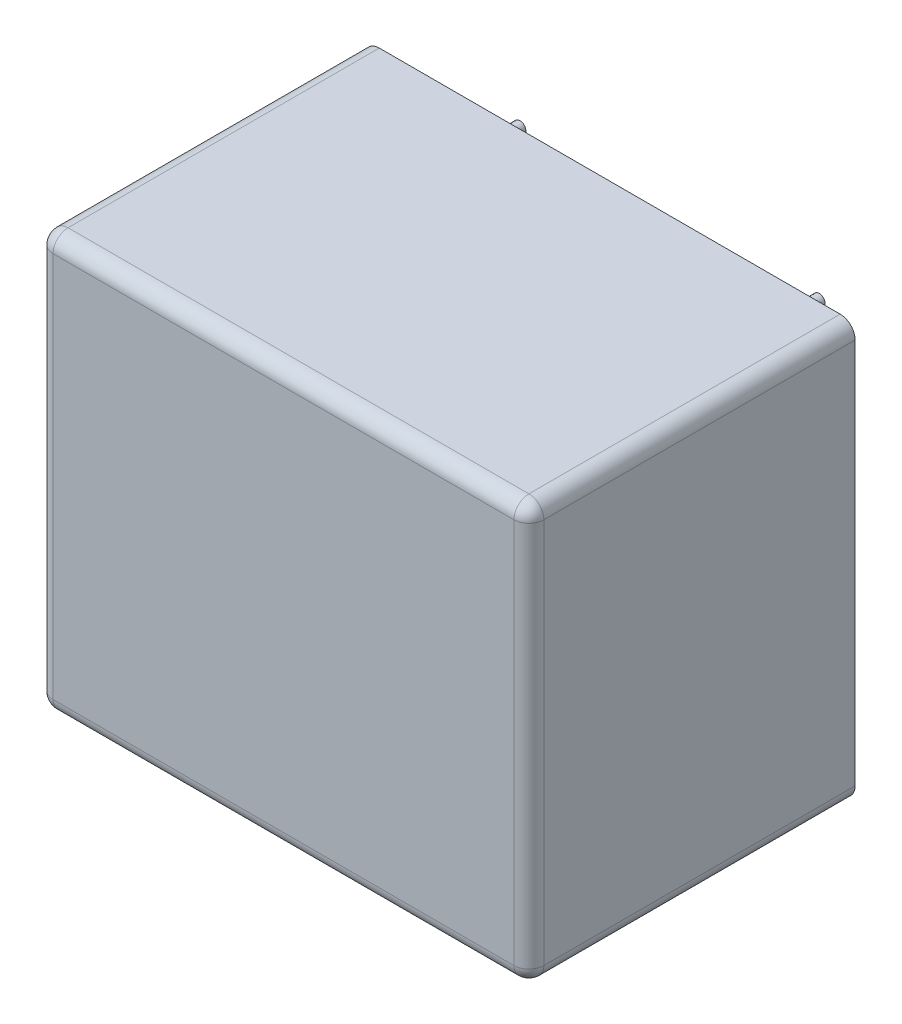
ISO-10303-21;
HEADER;
FILE_DESCRIPTION(('STEP AP214'),'2;1');
FILE_NAME('part.step','',(''),(''),'','','');
FILE_SCHEMA(('AUTOMOTIVE_DESIGN { 1 0 10303 214 1 1 1 1 }'));
ENDSEC;
DATA;
#1=APPLICATION_CONTEXT('core data for automotive mechanical design processes');
#2=APPLICATION_PROTOCOL_DEFINITION('international standard','automotive_design',2000,#1);
#3=PRODUCT_CONTEXT('',#1,'mechanical');
#4=PRODUCT('Part','Part','',(#3));
#5=PRODUCT_RELATED_PRODUCT_CATEGORY('part','',(#4));
#6=PRODUCT_DEFINITION_FORMATION('','',#4);
#7=PRODUCT_DEFINITION_CONTEXT('part definition',#1,'design');
#8=PRODUCT_DEFINITION('design','',#6,#7);
#9=PRODUCT_DEFINITION_SHAPE('','',#8);
#10=(LENGTH_UNIT() NAMED_UNIT(*) SI_UNIT(.MILLI.,.METRE.));
#11=(NAMED_UNIT(*) PLANE_ANGLE_UNIT() SI_UNIT($,.RADIAN.));
#12=(NAMED_UNIT(*) SI_UNIT($,.STERADIAN.) SOLID_ANGLE_UNIT());
#13=UNCERTAINTY_MEASURE_WITH_UNIT(LENGTH_MEASURE(1.E-05),#10,'distance_accuracy_value','');
#14=(GEOMETRIC_REPRESENTATION_CONTEXT(3) GLOBAL_UNCERTAINTY_ASSIGNED_CONTEXT((#13)) GLOBAL_UNIT_ASSIGNED_CONTEXT((#10,
#11,#12)) REPRESENTATION_CONTEXT('',''));
#15=CARTESIAN_POINT('',(0.,0.,0.));
#16=DIRECTION('',(0.,0.,1.));
#17=DIRECTION('',(1.,0.,0.));
#18=AXIS2_PLACEMENT_3D('',#15,#16,#17);
#19=CARTESIAN_POINT('',(31.8,1.,21.8));
#20=DIRECTION('',(0.,0.,-1.));
#21=DIRECTION('',(-1.,0.,0.));
#22=AXIS2_PLACEMENT_3D('',#19,#20,#21);
#23=CYLINDRICAL_SURFACE('',#22,1.);
#24=DIRECTION('',(0.,0.,-1.));
#25=VECTOR('',#24,1.);
#26=CARTESIAN_POINT('',(32.8,1.00000000000001,21.8));
#27=LINE('',#26,#25);
#28=CARTESIAN_POINT('',(32.8,1.00000000000001,20.8));
#29=VERTEX_POINT('',#28);
#30=CARTESIAN_POINT('',(32.8,1.00000000000001,0.));
#31=VERTEX_POINT('',#30);
#32=EDGE_CURVE('E113',#29,#31,#27,.T.);
#33=ORIENTED_EDGE('',*,*,#32,.F.);
#34=CARTESIAN_POINT('',(31.8,1.,20.8));
#35=DIRECTION('',(0.,0.,-1.));
#36=DIRECTION('',(-1.,0.,0.));
#37=AXIS2_PLACEMENT_3D('',#34,#35,#36);
#38=CIRCLE('',#37,1.);
#39=CARTESIAN_POINT('',(31.8,0.,20.8));
#40=VERTEX_POINT('',#39);
#41=EDGE_CURVE('E185',#29,#40,#38,.T.);
#42=ORIENTED_EDGE('',*,*,#41,.T.);
#43=DIRECTION('',(0.,0.,-1.));
#44=VECTOR('',#43,1.);
#45=CARTESIAN_POINT('',(31.8,0.,21.8));
#46=LINE('',#45,#44);
#47=CARTESIAN_POINT('',(31.8,0.,0.));
#48=VERTEX_POINT('',#47);
#49=EDGE_CURVE('E137',#40,#48,#46,.T.);
#50=ORIENTED_EDGE('',*,*,#49,.T.);
#51=CARTESIAN_POINT('',(31.8,1.,0.));
#52=DIRECTION('',(0.,0.,1.));
#53=DIRECTION('',(1.,0.,0.));
#54=AXIS2_PLACEMENT_3D('',#51,#52,#53);
#55=CIRCLE('',#54,1.);
#56=EDGE_CURVE('E131',#48,#31,#55,.T.);
#57=ORIENTED_EDGE('',*,*,#56,.T.);
#58=EDGE_LOOP('',(#33,#42,#50,#57));
#59=FACE_BOUND('',#58,.T.);
#60=ADVANCED_FACE('F35',(#59),#23,.T.);
#61=CARTESIAN_POINT('',(32.8,1.00000000000001,21.8));
#62=DIRECTION('',(-1.,0.,0.));
#63=DIRECTION('',(0.,0.,1.));
#64=AXIS2_PLACEMENT_3D('',#61,#62,#63);
#65=PLANE('',#64);
#66=DIRECTION('',(0.,0.,-1.));
#67=VECTOR('',#66,1.);
#68=CARTESIAN_POINT('',(32.8,26.8,21.8));
#69=LINE('',#68,#67);
#70=CARTESIAN_POINT('',(32.8,26.8,20.8));
#71=VERTEX_POINT('',#70);
#72=CARTESIAN_POINT('',(32.8,26.8,0.));
#73=VERTEX_POINT('',#72);
#74=EDGE_CURVE('E125',#71,#73,#69,.T.);
#75=ORIENTED_EDGE('',*,*,#74,.F.);
#76=DIRECTION('',(0.,1.,0.));
#77=VECTOR('',#76,1.);
#78=CARTESIAN_POINT('',(32.8,1.00000000000001,20.8));
#79=LINE('',#78,#77);
#80=EDGE_CURVE('E120',#71,#29,#79,.F.);
#81=ORIENTED_EDGE('',*,*,#80,.T.);
#82=ORIENTED_EDGE('',*,*,#32,.T.);
#83=DIRECTION('',(0.,1.,0.));
#84=VECTOR('',#83,1.);
#85=CARTESIAN_POINT('',(32.8,1.00000000000001,0.));
#86=LINE('',#85,#84);
#87=EDGE_CURVE('E117',#31,#73,#86,.T.);
#88=ORIENTED_EDGE('',*,*,#87,.T.);
#89=EDGE_LOOP('',(#75,#81,#82,#88));
#90=FACE_BOUND('',#89,.T.);
#91=ADVANCED_FACE('F116',(#90),#65,.F.);
#92=CARTESIAN_POINT('',(31.8,26.8,21.8));
#93=DIRECTION('',(0.,0.,-1.));
#94=DIRECTION('',(-1.,0.,0.));
#95=AXIS2_PLACEMENT_3D('',#92,#93,#94);
#96=CYLINDRICAL_SURFACE('',#95,1.);
#97=DIRECTION('',(0.,0.,-1.));
#98=VECTOR('',#97,1.);
#99=CARTESIAN_POINT('',(31.8,27.8,21.8));
#100=LINE('',#99,#98);
#101=CARTESIAN_POINT('',(31.8,27.8,20.8));
#102=VERTEX_POINT('',#101);
#103=CARTESIAN_POINT('',(31.8,27.8,0.));
#104=VERTEX_POINT('',#103);
#105=EDGE_CURVE('E170',#102,#104,#100,.T.);
#106=ORIENTED_EDGE('',*,*,#105,.F.);
#107=CARTESIAN_POINT('',(31.8,26.8,20.8));
#108=DIRECTION('',(0.,0.,-1.));
#109=DIRECTION('',(-1.,0.,0.));
#110=AXIS2_PLACEMENT_3D('',#107,#108,#109);
#111=CIRCLE('',#110,1.);
#112=EDGE_CURVE('E124',#102,#71,#111,.T.);
#113=ORIENTED_EDGE('',*,*,#112,.T.);
#114=ORIENTED_EDGE('',*,*,#74,.T.);
#115=CARTESIAN_POINT('',(31.8,26.8,0.));
#116=DIRECTION('',(0.,0.,1.));
#117=DIRECTION('',(-1.,0.,0.));
#118=AXIS2_PLACEMENT_3D('',#115,#116,#117);
#119=CIRCLE('',#118,1.);
#120=EDGE_CURVE('E134',#73,#104,#119,.T.);
#121=ORIENTED_EDGE('',*,*,#120,.T.);
#122=EDGE_LOOP('',(#106,#113,#114,#121));
#123=FACE_BOUND('',#122,.T.);
#124=ADVANCED_FACE('F252',(#123),#96,.T.);
#125=CARTESIAN_POINT('',(1.00000000000001,27.8,21.8));
#126=DIRECTION('',(0.,-1.,0.));
#127=DIRECTION('',(0.,0.,-1.));
#128=AXIS2_PLACEMENT_3D('',#125,#126,#127);
#129=PLANE('',#128);
#130=DIRECTION('',(0.,0.,-1.));
#131=VECTOR('',#130,1.);
#132=CARTESIAN_POINT('',(1.00000000000001,27.8,21.8));
#133=LINE('',#132,#131);
#134=CARTESIAN_POINT('',(1.00000000000001,27.8,20.8));
#135=VERTEX_POINT('',#134);
#136=CARTESIAN_POINT('',(1.00000000000001,27.8,0.));
#137=VERTEX_POINT('',#136);
#138=EDGE_CURVE('E168',#135,#137,#133,.T.);
#139=ORIENTED_EDGE('',*,*,#138,.F.);
#140=DIRECTION('',(-1.,0.,0.));
#141=VECTOR('',#140,1.);
#142=CARTESIAN_POINT('',(31.8,27.8,20.8));
#143=LINE('',#142,#141);
#144=EDGE_CURVE('E11',#135,#102,#143,.F.);
#145=ORIENTED_EDGE('',*,*,#144,.T.);
#146=ORIENTED_EDGE('',*,*,#105,.T.);
#147=DIRECTION('',(-1.,0.,0.));
#148=VECTOR('',#147,1.);
#149=CARTESIAN_POINT('',(1.00000000000001,27.8,0.));
#150=LINE('',#149,#148);
#151=EDGE_CURVE('E147',#104,#137,#150,.T.);
#152=ORIENTED_EDGE('',*,*,#151,.T.);
#153=EDGE_LOOP('',(#139,#145,#146,#152));
#154=FACE_BOUND('',#153,.T.);
#155=ADVANCED_FACE('F479',(#154),#129,.F.);
#156=CARTESIAN_POINT('',(1.,26.8,21.8));
#157=DIRECTION('',(0.,0.,-1.));
#158=DIRECTION('',(-1.,0.,0.));
#159=AXIS2_PLACEMENT_3D('',#156,#157,#158);
#160=CYLINDRICAL_SURFACE('',#159,1.);
#161=DIRECTION('',(0.,0.,-1.));
#162=VECTOR('',#161,1.);
#163=CARTESIAN_POINT('',(0.,26.8,21.8));
#164=LINE('',#163,#162);
#165=CARTESIAN_POINT('',(0.,26.8,20.8));
#166=VERTEX_POINT('',#165);
#167=CARTESIAN_POINT('',(0.,26.8,0.));
#168=VERTEX_POINT('',#167);
#169=EDGE_CURVE('E166',#166,#168,#164,.T.);
#170=ORIENTED_EDGE('',*,*,#169,.F.);
#171=CARTESIAN_POINT('',(1.,26.8,20.8));
#172=DIRECTION('',(0.,0.,-1.));
#173=DIRECTION('',(-1.,0.,0.));
#174=AXIS2_PLACEMENT_3D('',#171,#172,#173);
#175=CIRCLE('',#174,1.);
#176=EDGE_CURVE('E44',#166,#135,#175,.T.);
#177=ORIENTED_EDGE('',*,*,#176,.T.);
#178=ORIENTED_EDGE('',*,*,#138,.T.);
#179=CARTESIAN_POINT('',(1.,26.8,0.));
#180=DIRECTION('',(0.,0.,1.));
#181=DIRECTION('',(-1.,0.,0.));
#182=AXIS2_PLACEMENT_3D('',#179,#180,#181);
#183=CIRCLE('',#182,1.);
#184=EDGE_CURVE('E150',#137,#168,#183,.T.);
#185=ORIENTED_EDGE('',*,*,#184,.T.);
#186=EDGE_LOOP('',(#170,#177,#178,#185));
#187=FACE_BOUND('',#186,.T.);
#188=ADVANCED_FACE('F469',(#187),#160,.T.);
#189=CARTESIAN_POINT('',(0.,1.00000000000001,21.8));
#190=DIRECTION('',(1.,0.,0.));
#191=DIRECTION('',(0.,0.,-1.));
#192=AXIS2_PLACEMENT_3D('',#189,#190,#191);
#193=PLANE('',#192);
#194=DIRECTION('',(0.,0.,-1.));
#195=VECTOR('',#194,1.);
#196=CARTESIAN_POINT('',(0.,1.,21.8));
#197=LINE('',#196,#195);
#198=CARTESIAN_POINT('',(0.,1.,20.8));
#199=VERTEX_POINT('',#198);
#200=CARTESIAN_POINT('',(0.,1.,0.));
#201=VERTEX_POINT('',#200);
#202=EDGE_CURVE('E164',#199,#201,#197,.T.);
#203=ORIENTED_EDGE('',*,*,#202,.F.);
#204=DIRECTION('',(0.,-1.,0.));
#205=VECTOR('',#204,1.);
#206=CARTESIAN_POINT('',(0.,26.8,20.8));
#207=LINE('',#206,#205);
#208=EDGE_CURVE('E59',#199,#166,#207,.F.);
#209=ORIENTED_EDGE('',*,*,#208,.T.);
#210=ORIENTED_EDGE('',*,*,#169,.T.);
#211=DIRECTION('',(0.,-1.,0.));
#212=VECTOR('',#211,1.);
#213=CARTESIAN_POINT('',(0.,1.00000000000001,0.));
#214=LINE('',#213,#212);
#215=EDGE_CURVE('E153',#168,#201,#214,.T.);
#216=ORIENTED_EDGE('',*,*,#215,.T.);
#217=EDGE_LOOP('',(#203,#209,#210,#216));
#218=FACE_BOUND('',#217,.T.);
#219=ADVANCED_FACE('F459',(#218),#193,.F.);
#220=CARTESIAN_POINT('',(1.,1.,21.8));
#221=DIRECTION('',(0.,0.,-1.));
#222=DIRECTION('',(-1.,0.,0.));
#223=AXIS2_PLACEMENT_3D('',#220,#221,#222);
#224=CYLINDRICAL_SURFACE('',#223,1.);
#225=DIRECTION('',(0.,0.,-1.));
#226=VECTOR('',#225,1.);
#227=CARTESIAN_POINT('',(1.00000000000001,0.,21.8));
#228=LINE('',#227,#226);
#229=CARTESIAN_POINT('',(1.00000000000001,0.,20.8));
#230=VERTEX_POINT('',#229);
#231=CARTESIAN_POINT('',(1.00000000000001,0.,0.));
#232=VERTEX_POINT('',#231);
#233=EDGE_CURVE('E162',#230,#232,#228,.T.);
#234=ORIENTED_EDGE('',*,*,#233,.F.);
#235=CARTESIAN_POINT('',(1.,1.,20.8));
#236=DIRECTION('',(0.,0.,-1.));
#237=DIRECTION('',(-1.,0.,0.));
#238=AXIS2_PLACEMENT_3D('',#235,#236,#237);
#239=CIRCLE('',#238,1.);
#240=EDGE_CURVE('E189',#230,#199,#239,.T.);
#241=ORIENTED_EDGE('',*,*,#240,.T.);
#242=ORIENTED_EDGE('',*,*,#202,.T.);
#243=CARTESIAN_POINT('',(1.,1.,0.));
#244=DIRECTION('',(0.,0.,1.));
#245=DIRECTION('',(-1.,0.,0.));
#246=AXIS2_PLACEMENT_3D('',#243,#244,#245);
#247=CIRCLE('',#246,1.);
#248=EDGE_CURVE('E156',#201,#232,#247,.T.);
#249=ORIENTED_EDGE('',*,*,#248,.T.);
#250=EDGE_LOOP('',(#234,#241,#242,#249));
#251=FACE_BOUND('',#250,.T.);
#252=ADVANCED_FACE('F449',(#251),#224,.T.);
#253=CARTESIAN_POINT('',(1.00000000000001,0.,21.8));
#254=DIRECTION('',(0.,1.,0.));
#255=DIRECTION('',(0.,0.,1.));
#256=AXIS2_PLACEMENT_3D('',#253,#254,#255);
#257=PLANE('',#256);
#258=ORIENTED_EDGE('',*,*,#49,.F.);
#259=DIRECTION('',(1.,0.,0.));
#260=VECTOR('',#259,1.);
#261=CARTESIAN_POINT('',(1.00000000000001,0.,20.8));
#262=LINE('',#261,#260);
#263=EDGE_CURVE('E187',#40,#230,#262,.F.);
#264=ORIENTED_EDGE('',*,*,#263,.T.);
#265=ORIENTED_EDGE('',*,*,#233,.T.);
#266=DIRECTION('',(1.,0.,0.));
#267=VECTOR('',#266,1.);
#268=CARTESIAN_POINT('',(1.00000000000001,0.,0.));
#269=LINE('',#268,#267);
#270=EDGE_CURVE('E159',#232,#48,#269,.T.);
#271=ORIENTED_EDGE('',*,*,#270,.T.);
#272=EDGE_LOOP('',(#258,#264,#265,#271));
#273=FACE_BOUND('',#272,.T.);
#274=ADVANCED_FACE('F440',(#273),#257,.F.);
#275=CARTESIAN_POINT('',(31.8,1.,21.8));
#276=DIRECTION('',(0.,0.,1.));
#277=DIRECTION('',(1.,0.,0.));
#278=AXIS2_PLACEMENT_3D('',#275,#276,#277);
#279=PLANE('',#278);
#280=DIRECTION('',(1.,0.,0.));
#281=VECTOR('',#280,1.);
#282=CARTESIAN_POINT('',(31.8,1.,21.8));
#283=LINE('',#282,#281);
#284=CARTESIAN_POINT('',(1.,1.,21.8));
#285=VERTEX_POINT('',#284);
#286=CARTESIAN_POINT('',(31.8,1.,21.8));
#287=VERTEX_POINT('',#286);
#288=EDGE_CURVE('E179',#285,#287,#283,.T.);
#289=ORIENTED_EDGE('',*,*,#288,.T.);
#290=DIRECTION('',(0.,1.,0.));
#291=VECTOR('',#290,1.);
#292=CARTESIAN_POINT('',(31.8,26.8,21.8));
#293=LINE('',#292,#291);
#294=CARTESIAN_POINT('',(31.8,26.8,21.8));
#295=VERTEX_POINT('',#294);
#296=EDGE_CURVE('E181',#287,#295,#293,.T.);
#297=ORIENTED_EDGE('',*,*,#296,.T.);
#298=DIRECTION('',(-1.,0.,0.));
#299=VECTOR('',#298,1.);
#300=CARTESIAN_POINT('',(1.00000000000001,26.8,21.8));
#301=LINE('',#300,#299);
#302=CARTESIAN_POINT('',(1.,26.8,21.8));
#303=VERTEX_POINT('',#302);
#304=EDGE_CURVE('E175',#295,#303,#301,.T.);
#305=ORIENTED_EDGE('',*,*,#304,.T.);
#306=DIRECTION('',(0.,-1.,0.));
#307=VECTOR('',#306,1.);
#308=CARTESIAN_POINT('',(1.,1.,21.8));
#309=LINE('',#308,#307);
#310=EDGE_CURVE('E177',#303,#285,#309,.T.);
#311=ORIENTED_EDGE('',*,*,#310,.T.);
#312=EDGE_LOOP('',(#289,#297,#305,#311));
#313=FACE_BOUND('',#312,.T.);
#314=ADVANCED_FACE('F225',(#313),#279,.T.);
#315=CARTESIAN_POINT('',(31.8,1.,0.));
#316=DIRECTION('',(0.,0.,1.));
#317=DIRECTION('',(1.,0.,0.));
#318=AXIS2_PLACEMENT_3D('',#315,#316,#317);
#319=PLANE('',#318);
#320=CARTESIAN_POINT('',(11.4,3.9,0.));
#321=DIRECTION('',(0.,0.,1.));
#322=DIRECTION('',(1.,0.,0.));
#323=AXIS2_PLACEMENT_3D('',#320,#321,#322);
#324=CIRCLE('',#323,0.400000000000001);
#325=CARTESIAN_POINT('',(11.8,3.9,0.));
#326=VERTEX_POINT('',#325);
#327=EDGE_CURVE('E536',#326,#326,#324,.T.);
#328=ORIENTED_EDGE('',*,*,#327,.T.);
#329=EDGE_LOOP('',(#328));
#330=FACE_BOUND('',#329,.T.);
#331=CARTESIAN_POINT('',(6.4,23.9,0.));
#332=DIRECTION('',(0.,0.,1.));
#333=DIRECTION('',(1.,0.,0.));
#334=AXIS2_PLACEMENT_3D('',#331,#332,#333);
#335=CIRCLE('',#334,0.400000000000002);
#336=CARTESIAN_POINT('',(6.8,23.9,0.));
#337=VERTEX_POINT('',#336);
#338=EDGE_CURVE('E540',#337,#337,#335,.T.);
#339=ORIENTED_EDGE('',*,*,#338,.T.);
#340=EDGE_LOOP('',(#339));
#341=FACE_BOUND('',#340,.T.);
#342=CARTESIAN_POINT('',(26.4,23.9,0.));
#343=DIRECTION('',(0.,0.,1.));
#344=DIRECTION('',(1.,0.,0.));
#345=AXIS2_PLACEMENT_3D('',#342,#343,#344);
#346=CIRCLE('',#345,0.400000000000005);
#347=CARTESIAN_POINT('',(26.8,23.9,0.));
#348=VERTEX_POINT('',#347);
#349=EDGE_CURVE('E544',#348,#348,#346,.T.);
#350=ORIENTED_EDGE('',*,*,#349,.T.);
#351=EDGE_LOOP('',(#350));
#352=FACE_BOUND('',#351,.T.);
#353=CARTESIAN_POINT('',(21.4,3.9,0.));
#354=DIRECTION('',(0.,0.,1.));
#355=DIRECTION('',(1.,0.,0.));
#356=AXIS2_PLACEMENT_3D('',#353,#354,#355);
#357=CIRCLE('',#356,0.400000000000001);
#358=CARTESIAN_POINT('',(21.8,3.9,0.));
#359=VERTEX_POINT('',#358);
#360=EDGE_CURVE('E143',#359,#359,#357,.T.);
#361=ORIENTED_EDGE('',*,*,#360,.T.);
#362=EDGE_LOOP('',(#361));
#363=FACE_BOUND('',#362,.T.);
#364=ORIENTED_EDGE('',*,*,#56,.F.);
#365=ORIENTED_EDGE('',*,*,#270,.F.);
#366=ORIENTED_EDGE('',*,*,#248,.F.);
#367=ORIENTED_EDGE('',*,*,#215,.F.);
#368=ORIENTED_EDGE('',*,*,#184,.F.);
#369=ORIENTED_EDGE('',*,*,#151,.F.);
#370=ORIENTED_EDGE('',*,*,#120,.F.);
#371=ORIENTED_EDGE('',*,*,#87,.F.);
#372=EDGE_LOOP('',(#364,#365,#366,#367,#368,#369,#370,#371));
#373=FACE_BOUND('',#372,.T.);
#374=ADVANCED_FACE('F129',(#330,#341,#352,#363,#373),#319,.F.);
#375=CARTESIAN_POINT('',(1.,1.,20.8));
#376=DIRECTION('',(0.,0.,1.));
#377=DIRECTION('',(1.,0.,0.));
#378=AXIS2_PLACEMENT_3D('',#375,#376,#377);
#379=SPHERICAL_SURFACE('',#378,1.);
#380=CARTESIAN_POINT('',(1.,1.,20.8));
#381=DIRECTION('',(0.,1.,0.));
#382=DIRECTION('',(0.,0.,1.));
#383=AXIS2_PLACEMENT_3D('',#380,#381,#382);
#384=CIRCLE('',#383,1.);
#385=EDGE_CURVE('E141',#199,#285,#384,.T.);
#386=ORIENTED_EDGE('',*,*,#385,.F.);
#387=ORIENTED_EDGE('',*,*,#240,.F.);
#388=CARTESIAN_POINT('',(1.,1.,20.8));
#389=DIRECTION('',(1.,0.,0.));
#390=DIRECTION('',(0.,1.,0.));
#391=AXIS2_PLACEMENT_3D('',#388,#389,#390);
#392=CIRCLE('',#391,1.);
#393=EDGE_CURVE('E39',#285,#230,#392,.T.);
#394=ORIENTED_EDGE('',*,*,#393,.F.);
#395=EDGE_LOOP('',(#386,#387,#394));
#396=FACE_BOUND('',#395,.T.);
#397=ADVANCED_FACE('F37',(#396),#379,.T.);
#398=CARTESIAN_POINT('',(31.8,1.,20.8));
#399=DIRECTION('',(-1.,0.,0.));
#400=DIRECTION('',(0.,0.,1.));
#401=AXIS2_PLACEMENT_3D('',#398,#399,#400);
#402=CYLINDRICAL_SURFACE('',#401,1.);
#403=ORIENTED_EDGE('',*,*,#393,.T.);
#404=ORIENTED_EDGE('',*,*,#263,.F.);
#405=CARTESIAN_POINT('',(31.8,1.,20.8));
#406=DIRECTION('',(1.,0.,0.));
#407=DIRECTION('',(0.,1.,0.));
#408=AXIS2_PLACEMENT_3D('',#405,#406,#407);
#409=CIRCLE('',#408,1.);
#410=EDGE_CURVE('E207',#287,#40,#409,.T.);
#411=ORIENTED_EDGE('',*,*,#410,.F.);
#412=ORIENTED_EDGE('',*,*,#288,.F.);
#413=EDGE_LOOP('',(#403,#404,#411,#412));
#414=FACE_BOUND('',#413,.T.);
#415=ADVANCED_FACE('F222',(#414),#402,.T.);
#416=CARTESIAN_POINT('',(1.,1.,20.8));
#417=DIRECTION('',(0.,1.,0.));
#418=DIRECTION('',(0.,0.,1.));
#419=AXIS2_PLACEMENT_3D('',#416,#417,#418);
#420=CYLINDRICAL_SURFACE('',#419,1.);
#421=ORIENTED_EDGE('',*,*,#385,.T.);
#422=ORIENTED_EDGE('',*,*,#310,.F.);
#423=CARTESIAN_POINT('',(1.,26.8,20.8));
#424=DIRECTION('',(0.,1.,0.));
#425=DIRECTION('',(0.,0.,1.));
#426=AXIS2_PLACEMENT_3D('',#423,#424,#425);
#427=CIRCLE('',#426,1.);
#428=EDGE_CURVE('E204',#166,#303,#427,.T.);
#429=ORIENTED_EDGE('',*,*,#428,.F.);
#430=ORIENTED_EDGE('',*,*,#208,.F.);
#431=EDGE_LOOP('',(#421,#422,#429,#430));
#432=FACE_BOUND('',#431,.T.);
#433=ADVANCED_FACE('F214',(#432),#420,.T.);
#434=CARTESIAN_POINT('',(31.8,1.,20.8));
#435=DIRECTION('',(0.,0.,1.));
#436=DIRECTION('',(1.,0.,0.));
#437=AXIS2_PLACEMENT_3D('',#434,#435,#436);
#438=SPHERICAL_SURFACE('',#437,1.);
#439=ORIENTED_EDGE('',*,*,#410,.T.);
#440=ORIENTED_EDGE('',*,*,#41,.F.);
#441=CARTESIAN_POINT('',(31.8,1.,20.8));
#442=DIRECTION('',(0.,1.,0.));
#443=DIRECTION('',(-1.,0.,0.));
#444=AXIS2_PLACEMENT_3D('',#441,#442,#443);
#445=CIRCLE('',#444,1.);
#446=EDGE_CURVE('E201',#287,#29,#445,.T.);
#447=ORIENTED_EDGE('',*,*,#446,.F.);
#448=EDGE_LOOP('',(#439,#440,#447));
#449=FACE_BOUND('',#448,.T.);
#450=ADVANCED_FACE('F237',(#449),#438,.T.);
#451=CARTESIAN_POINT('',(1.,26.8,20.8));
#452=DIRECTION('',(0.,0.,1.));
#453=DIRECTION('',(1.,0.,0.));
#454=AXIS2_PLACEMENT_3D('',#451,#452,#453);
#455=SPHERICAL_SURFACE('',#454,1.);
#456=ORIENTED_EDGE('',*,*,#176,.F.);
#457=ORIENTED_EDGE('',*,*,#428,.T.);
#458=CARTESIAN_POINT('',(1.,26.8,20.8));
#459=DIRECTION('',(1.,0.,0.));
#460=DIRECTION('',(0.,1.,0.));
#461=AXIS2_PLACEMENT_3D('',#458,#459,#460);
#462=CIRCLE('',#461,1.);
#463=EDGE_CURVE('E198',#135,#303,#462,.T.);
#464=ORIENTED_EDGE('',*,*,#463,.F.);
#465=EDGE_LOOP('',(#456,#457,#464));
#466=FACE_BOUND('',#465,.T.);
#467=ADVANCED_FACE('F234',(#466),#455,.T.);
#468=CARTESIAN_POINT('',(31.8,1.,20.8));
#469=DIRECTION('',(0.,-1.,0.));
#470=DIRECTION('',(0.,0.,-1.));
#471=AXIS2_PLACEMENT_3D('',#468,#469,#470);
#472=CYLINDRICAL_SURFACE('',#471,1.);
#473=ORIENTED_EDGE('',*,*,#446,.T.);
#474=ORIENTED_EDGE('',*,*,#80,.F.);
#475=CARTESIAN_POINT('',(31.8,26.8,20.8));
#476=DIRECTION('',(0.,1.,0.));
#477=DIRECTION('',(-1.,0.,0.));
#478=AXIS2_PLACEMENT_3D('',#475,#476,#477);
#479=CIRCLE('',#478,1.);
#480=EDGE_CURVE('E195',#295,#71,#479,.T.);
#481=ORIENTED_EDGE('',*,*,#480,.F.);
#482=ORIENTED_EDGE('',*,*,#296,.F.);
#483=EDGE_LOOP('',(#473,#474,#481,#482));
#484=FACE_BOUND('',#483,.T.);
#485=ADVANCED_FACE('F236',(#484),#472,.T.);
#486=CARTESIAN_POINT('',(31.8,26.8,20.8));
#487=DIRECTION('',(1.,0.,0.));
#488=DIRECTION('',(0.,0.,-1.));
#489=AXIS2_PLACEMENT_3D('',#486,#487,#488);
#490=CYLINDRICAL_SURFACE('',#489,1.);
#491=ORIENTED_EDGE('',*,*,#463,.T.);
#492=ORIENTED_EDGE('',*,*,#304,.F.);
#493=CARTESIAN_POINT('',(31.8,26.8,20.8));
#494=DIRECTION('',(1.,0.,0.));
#495=DIRECTION('',(0.,0.,-1.));
#496=AXIS2_PLACEMENT_3D('',#493,#494,#495);
#497=CIRCLE('',#496,1.);
#498=EDGE_CURVE('E193',#102,#295,#497,.T.);
#499=ORIENTED_EDGE('',*,*,#498,.F.);
#500=ORIENTED_EDGE('',*,*,#144,.F.);
#501=EDGE_LOOP('',(#491,#492,#499,#500));
#502=FACE_BOUND('',#501,.T.);
#503=ADVANCED_FACE('F230',(#502),#490,.T.);
#504=CARTESIAN_POINT('',(31.8,26.8,20.8));
#505=DIRECTION('',(0.,0.,1.));
#506=DIRECTION('',(1.,0.,0.));
#507=AXIS2_PLACEMENT_3D('',#504,#505,#506);
#508=SPHERICAL_SURFACE('',#507,1.);
#509=ORIENTED_EDGE('',*,*,#480,.T.);
#510=ORIENTED_EDGE('',*,*,#112,.F.);
#511=ORIENTED_EDGE('',*,*,#498,.T.);
#512=EDGE_LOOP('',(#509,#510,#511));
#513=FACE_BOUND('',#512,.T.);
#514=ADVANCED_FACE('F256',(#513),#508,.T.);
#515=CARTESIAN_POINT('',(21.4,3.9,-4.));
#516=DIRECTION('',(0.,0.,1.));
#517=DIRECTION('',(1.,0.,0.));
#518=AXIS2_PLACEMENT_3D('',#515,#516,#517);
#519=CYLINDRICAL_SURFACE('',#518,0.400000000000001);
#520=CARTESIAN_POINT('',(21.4,3.9,-4.));
#521=DIRECTION('',(0.,0.,1.));
#522=DIRECTION('',(1.,0.,0.));
#523=AXIS2_PLACEMENT_3D('',#520,#521,#522);
#524=CIRCLE('',#523,0.400000000000001);
#525=CARTESIAN_POINT('',(21.8,3.9,-4.));
#526=VERTEX_POINT('',#525);
#527=EDGE_CURVE('E196',#526,#526,#524,.T.);
#528=ORIENTED_EDGE('',*,*,#527,.T.);
#529=EDGE_LOOP('',(#528));
#530=FACE_BOUND('',#529,.T.);
#531=ORIENTED_EDGE('',*,*,#360,.F.);
#532=EDGE_LOOP('',(#531));
#533=FACE_BOUND('',#532,.T.);
#534=ADVANCED_FACE('F259',(#530,#533),#519,.T.);
#535=CARTESIAN_POINT('',(21.4,3.9,-4.));
#536=DIRECTION('',(0.,0.,1.));
#537=DIRECTION('',(1.,0.,0.));
#538=AXIS2_PLACEMENT_3D('',#535,#536,#537);
#539=PLANE('',#538);
#540=ORIENTED_EDGE('',*,*,#527,.F.);
#541=EDGE_LOOP('',(#540));
#542=FACE_BOUND('',#541,.T.);
#543=ADVANCED_FACE('F279',(#542),#539,.F.);
#544=CARTESIAN_POINT('',(26.4,23.9,-4.));
#545=DIRECTION('',(0.,0.,1.));
#546=DIRECTION('',(1.,0.,0.));
#547=AXIS2_PLACEMENT_3D('',#544,#545,#546);
#548=CYLINDRICAL_SURFACE('',#547,0.400000000000005);
#549=CARTESIAN_POINT('',(26.4,23.9,-4.));
#550=DIRECTION('',(0.,0.,1.));
#551=DIRECTION('',(1.,0.,0.));
#552=AXIS2_PLACEMENT_3D('',#549,#550,#551);
#553=CIRCLE('',#552,0.400000000000005);
#554=CARTESIAN_POINT('',(26.8,23.9,-4.));
#555=VERTEX_POINT('',#554);
#556=EDGE_CURVE('E548',#555,#555,#553,.T.);
#557=ORIENTED_EDGE('',*,*,#556,.T.);
#558=EDGE_LOOP('',(#557));
#559=FACE_BOUND('',#558,.T.);
#560=ORIENTED_EDGE('',*,*,#349,.F.);
#561=EDGE_LOOP('',(#560));
#562=FACE_BOUND('',#561,.T.);
#563=ADVANCED_FACE('F289',(#559,#562),#548,.T.);
#564=CARTESIAN_POINT('',(26.4,23.9,-4.));
#565=DIRECTION('',(0.,0.,1.));
#566=DIRECTION('',(1.,0.,0.));
#567=AXIS2_PLACEMENT_3D('',#564,#565,#566);
#568=PLANE('',#567);
#569=ORIENTED_EDGE('',*,*,#556,.F.);
#570=EDGE_LOOP('',(#569));
#571=FACE_BOUND('',#570,.T.);
#572=ADVANCED_FACE('F298',(#571),#568,.F.);
#573=CARTESIAN_POINT('',(6.4,23.9,-4.));
#574=DIRECTION('',(0.,0.,1.));
#575=DIRECTION('',(1.,0.,0.));
#576=AXIS2_PLACEMENT_3D('',#573,#574,#575);
#577=CYLINDRICAL_SURFACE('',#576,0.400000000000002);
#578=CARTESIAN_POINT('',(6.4,23.9,-4.));
#579=DIRECTION('',(0.,0.,1.));
#580=DIRECTION('',(1.,0.,0.));
#581=AXIS2_PLACEMENT_3D('',#578,#579,#580);
#582=CIRCLE('',#581,0.400000000000002);
#583=CARTESIAN_POINT('',(6.8,23.9,-4.));
#584=VERTEX_POINT('',#583);
#585=EDGE_CURVE('E553',#584,#584,#582,.T.);
#586=ORIENTED_EDGE('',*,*,#585,.T.);
#587=EDGE_LOOP('',(#586));
#588=FACE_BOUND('',#587,.T.);
#589=ORIENTED_EDGE('',*,*,#338,.F.);
#590=EDGE_LOOP('',(#589));
#591=FACE_BOUND('',#590,.T.);
#592=ADVANCED_FACE('F307',(#588,#591),#577,.T.);
#593=CARTESIAN_POINT('',(6.4,23.9,-4.));
#594=DIRECTION('',(0.,0.,1.));
#595=DIRECTION('',(1.,0.,0.));
#596=AXIS2_PLACEMENT_3D('',#593,#594,#595);
#597=PLANE('',#596);
#598=ORIENTED_EDGE('',*,*,#585,.F.);
#599=EDGE_LOOP('',(#598));
#600=FACE_BOUND('',#599,.T.);
#601=ADVANCED_FACE('F314',(#600),#597,.F.);
#602=CARTESIAN_POINT('',(11.4,3.9,-4.));
#603=DIRECTION('',(0.,0.,1.));
#604=DIRECTION('',(1.,0.,0.));
#605=AXIS2_PLACEMENT_3D('',#602,#603,#604);
#606=CYLINDRICAL_SURFACE('',#605,0.400000000000001);
#607=CARTESIAN_POINT('',(11.4,3.9,-4.));
#608=DIRECTION('',(0.,0.,1.));
#609=DIRECTION('',(1.,0.,0.));
#610=AXIS2_PLACEMENT_3D('',#607,#608,#609);
#611=CIRCLE('',#610,0.400000000000001);
#612=CARTESIAN_POINT('',(11.8,3.9,-4.));
#613=VERTEX_POINT('',#612);
#614=EDGE_CURVE('E557',#613,#613,#611,.T.);
#615=ORIENTED_EDGE('',*,*,#614,.T.);
#616=EDGE_LOOP('',(#615));
#617=FACE_BOUND('',#616,.T.);
#618=ORIENTED_EDGE('',*,*,#327,.F.);
#619=EDGE_LOOP('',(#618));
#620=FACE_BOUND('',#619,.T.);
#621=ADVANCED_FACE('F321',(#617,#620),#606,.T.);
#622=CARTESIAN_POINT('',(11.4,3.9,-4.));
#623=DIRECTION('',(0.,0.,1.));
#624=DIRECTION('',(1.,0.,0.));
#625=AXIS2_PLACEMENT_3D('',#622,#623,#624);
#626=PLANE('',#625);
#627=ORIENTED_EDGE('',*,*,#614,.F.);
#628=EDGE_LOOP('',(#627));
#629=FACE_BOUND('',#628,.T.);
#630=ADVANCED_FACE('F328',(#629),#626,.F.);
#631=CLOSED_SHELL('',(#60,#91,#124,#155,#188,#219,#252,#274,#314,#374,#397,#415,#433,#450,#467,
#485,#503,#514,#534,#543,#563,#572,#592,#601,#621,#630));
#632=MANIFOLD_SOLID_BREP('B2',#631);
#633=ADVANCED_BREP_SHAPE_REPRESENTATION('',(#18,#632),#14);
#634=SHAPE_DEFINITION_REPRESENTATION(#9,#633);
ENDSEC;
END-ISO-10303-21;
